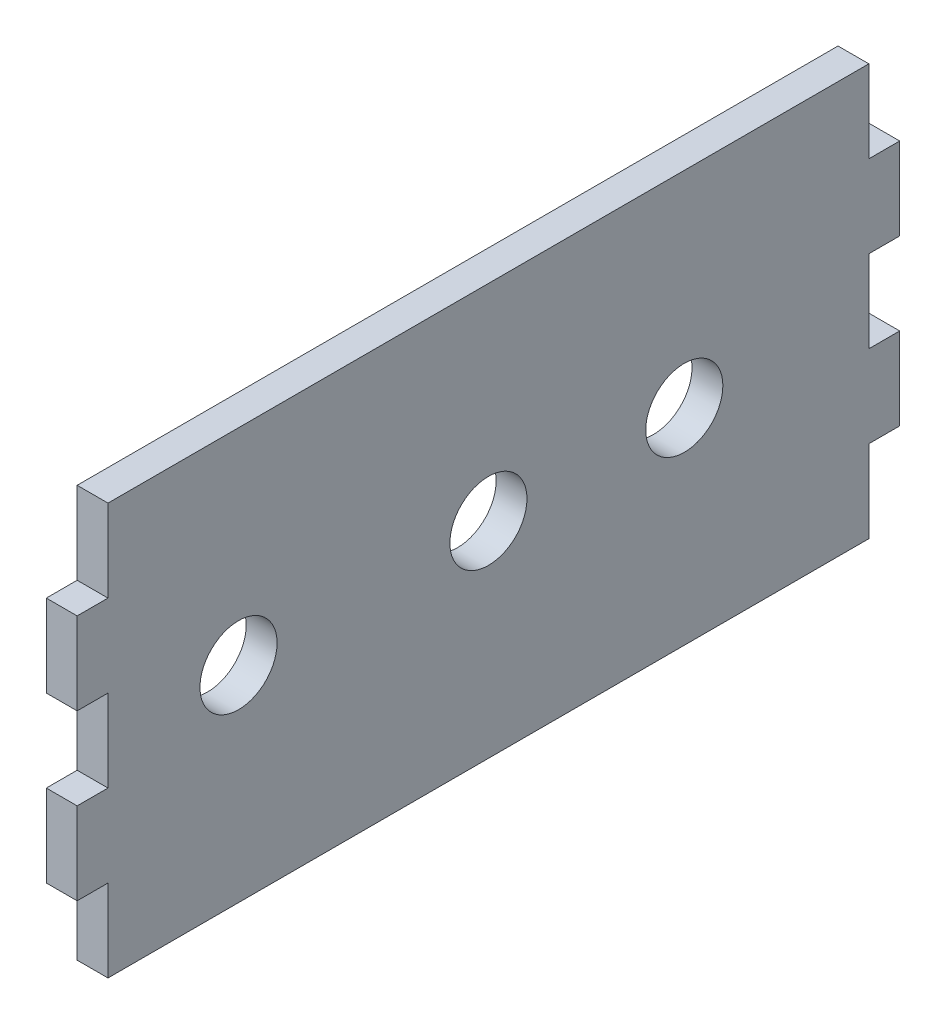
ISO-10303-21;
HEADER;
FILE_DESCRIPTION(('STEP AP214'),'2;1');
FILE_NAME('part.step','',(''),(''),'','','');
FILE_SCHEMA(('AUTOMOTIVE_DESIGN { 1 0 10303 214 1 1 1 1 }'));
ENDSEC;
DATA;
#1=APPLICATION_CONTEXT('core data for automotive mechanical design processes');
#2=APPLICATION_PROTOCOL_DEFINITION('international standard','automotive_design',2000,#1);
#3=PRODUCT_CONTEXT('',#1,'mechanical');
#4=PRODUCT('Part','Part','',(#3));
#5=PRODUCT_RELATED_PRODUCT_CATEGORY('part','',(#4));
#6=PRODUCT_DEFINITION_FORMATION('','',#4);
#7=PRODUCT_DEFINITION_CONTEXT('part definition',#1,'design');
#8=PRODUCT_DEFINITION('design','',#6,#7);
#9=PRODUCT_DEFINITION_SHAPE('','',#8);
#10=(LENGTH_UNIT() NAMED_UNIT(*) SI_UNIT(.MILLI.,.METRE.));
#11=(NAMED_UNIT(*) PLANE_ANGLE_UNIT() SI_UNIT($,.RADIAN.));
#12=(NAMED_UNIT(*) SI_UNIT($,.STERADIAN.) SOLID_ANGLE_UNIT());
#13=UNCERTAINTY_MEASURE_WITH_UNIT(LENGTH_MEASURE(1.E-05),#10,'distance_accuracy_value','');
#14=(GEOMETRIC_REPRESENTATION_CONTEXT(3) GLOBAL_UNCERTAINTY_ASSIGNED_CONTEXT((#13)) GLOBAL_UNIT_ASSIGNED_CONTEXT((#10,
#11,#12)) REPRESENTATION_CONTEXT('',''));
#15=CARTESIAN_POINT('',(0.,0.,0.));
#16=DIRECTION('',(0.,0.,1.));
#17=DIRECTION('',(1.,0.,0.));
#18=AXIS2_PLACEMENT_3D('',#15,#16,#17);
#19=CARTESIAN_POINT('',(6.,-40.0000000000001,80.));
#20=DIRECTION('',(0.,0.,-1.));
#21=DIRECTION('',(-1.,0.,0.));
#22=AXIS2_PLACEMENT_3D('',#19,#20,#21);
#23=PLANE('',#22);
#24=DIRECTION('',(0.,-1.,0.));
#25=VECTOR('',#24,1.);
#26=CARTESIAN_POINT('',(0.,-40.0000000000001,80.));
#27=LINE('',#26,#25);
#28=CARTESIAN_POINT('',(0.,23.9999999999999,80.));
#29=VERTEX_POINT('',#28);
#30=CARTESIAN_POINT('',(0.,7.99999999999999,80.));
#31=VERTEX_POINT('',#30);
#32=EDGE_CURVE('E208',#29,#31,#27,.T.);
#33=ORIENTED_EDGE('',*,*,#32,.T.);
#34=DIRECTION('',(1.,0.,0.));
#35=VECTOR('',#34,1.);
#36=CARTESIAN_POINT('',(0.,7.99999999999999,80.));
#37=LINE('',#36,#35);
#38=CARTESIAN_POINT('',(6.,7.99999999999999,80.));
#39=VERTEX_POINT('',#38);
#40=EDGE_CURVE('E266',#31,#39,#37,.T.);
#41=ORIENTED_EDGE('',*,*,#40,.T.);
#42=DIRECTION('',(0.,-1.,0.));
#43=VECTOR('',#42,1.);
#44=CARTESIAN_POINT('',(6.,-40.0000000000001,80.));
#45=LINE('',#44,#43);
#46=CARTESIAN_POINT('',(6.,23.9999999999999,80.));
#47=VERTEX_POINT('',#46);
#48=EDGE_CURVE('E219',#47,#39,#45,.T.);
#49=ORIENTED_EDGE('',*,*,#48,.F.);
#50=DIRECTION('',(1.,0.,0.));
#51=VECTOR('',#50,1.);
#52=CARTESIAN_POINT('',(0.,23.9999999999999,80.));
#53=LINE('',#52,#51);
#54=EDGE_CURVE('E241',#29,#47,#53,.T.);
#55=ORIENTED_EDGE('',*,*,#54,.F.);
#56=EDGE_LOOP('',(#33,#41,#49,#55));
#57=FACE_BOUND('',#56,.T.);
#58=ADVANCED_FACE('F37',(#57),#23,.F.);
#59=CARTESIAN_POINT('',(6.,-40.,-80.));
#60=DIRECTION('',(0.,0.,1.));
#61=DIRECTION('',(0.,-1.,0.));
#62=AXIS2_PLACEMENT_3D('',#59,#60,#61);
#63=PLANE('',#62);
#64=DIRECTION('',(0.,1.,0.));
#65=VECTOR('',#64,1.);
#66=CARTESIAN_POINT('',(6.,-40.,-80.));
#67=LINE('',#66,#65);
#68=CARTESIAN_POINT('',(6.,-23.9999999999999,-80.));
#69=VERTEX_POINT('',#68);
#70=CARTESIAN_POINT('',(6.,-7.99999999999993,-80.));
#71=VERTEX_POINT('',#70);
#72=EDGE_CURVE('E46',#69,#71,#67,.T.);
#73=ORIENTED_EDGE('',*,*,#72,.F.);
#74=DIRECTION('',(1.,0.,0.));
#75=VECTOR('',#74,1.);
#76=CARTESIAN_POINT('',(0.,-23.9999999999999,-80.));
#77=LINE('',#76,#75);
#78=CARTESIAN_POINT('',(0.,-23.9999999999999,-80.));
#79=VERTEX_POINT('',#78);
#80=EDGE_CURVE('E301',#79,#69,#77,.T.);
#81=ORIENTED_EDGE('',*,*,#80,.F.);
#82=DIRECTION('',(0.,1.,0.));
#83=VECTOR('',#82,1.);
#84=CARTESIAN_POINT('',(0.,-40.,-80.));
#85=LINE('',#84,#83);
#86=CARTESIAN_POINT('',(0.,-7.99999999999993,-80.));
#87=VERTEX_POINT('',#86);
#88=EDGE_CURVE('E204',#79,#87,#85,.T.);
#89=ORIENTED_EDGE('',*,*,#88,.T.);
#90=DIRECTION('',(1.,0.,0.));
#91=VECTOR('',#90,1.);
#92=CARTESIAN_POINT('',(0.,-7.99999999999993,-80.));
#93=LINE('',#92,#91);
#94=EDGE_CURVE('E279',#87,#71,#93,.T.);
#95=ORIENTED_EDGE('',*,*,#94,.T.);
#96=EDGE_LOOP('',(#73,#81,#89,#95));
#97=FACE_BOUND('',#96,.T.);
#98=ADVANCED_FACE('F354',(#97),#63,.F.);
#99=CARTESIAN_POINT('',(0.,-8.00000000000001,80.));
#100=VERTEX_POINT('',#99);
#101=CARTESIAN_POINT('',(0.,-24.,80.));
#102=VERTEX_POINT('',#101);
#103=EDGE_CURVE('E211',#100,#102,#27,.T.);
#104=ORIENTED_EDGE('',*,*,#103,.T.);
#105=DIRECTION('',(1.,0.,0.));
#106=VECTOR('',#105,1.);
#107=CARTESIAN_POINT('',(0.,-24.,80.));
#108=LINE('',#107,#106);
#109=CARTESIAN_POINT('',(6.,-24.,80.));
#110=VERTEX_POINT('',#109);
#111=EDGE_CURVE('E254',#102,#110,#108,.T.);
#112=ORIENTED_EDGE('',*,*,#111,.T.);
#113=CARTESIAN_POINT('',(6.,-8.00000000000001,80.));
#114=VERTEX_POINT('',#113);
#115=EDGE_CURVE('E220',#114,#110,#45,.T.);
#116=ORIENTED_EDGE('',*,*,#115,.F.);
#117=DIRECTION('',(1.,0.,0.));
#118=VECTOR('',#117,1.);
#119=CARTESIAN_POINT('',(0.,-8.00000000000001,80.));
#120=LINE('',#119,#118);
#121=EDGE_CURVE('E259',#100,#114,#120,.T.);
#122=ORIENTED_EDGE('',*,*,#121,.F.);
#123=EDGE_LOOP('',(#104,#112,#116,#122));
#124=FACE_BOUND('',#123,.T.);
#125=ADVANCED_FACE('F39',(#124),#23,.F.);
#126=CARTESIAN_POINT('',(6.,-40.,-80.));
#127=DIRECTION('',(0.,1.,0.));
#128=DIRECTION('',(0.,0.,1.));
#129=AXIS2_PLACEMENT_3D('',#126,#127,#128);
#130=PLANE('',#129);
#131=DIRECTION('',(0.,0.,-1.));
#132=VECTOR('',#131,1.);
#133=CARTESIAN_POINT('',(6.,-40.,-80.));
#134=LINE('',#133,#132);
#135=CARTESIAN_POINT('',(6.,-39.9999999999999,74.));
#136=VERTEX_POINT('',#135);
#137=CARTESIAN_POINT('',(6.,-39.9999999999999,-74.));
#138=VERTEX_POINT('',#137);
#139=EDGE_CURVE('E216',#136,#138,#134,.T.);
#140=ORIENTED_EDGE('',*,*,#139,.F.);
#141=DIRECTION('',(1.,0.,0.));
#142=VECTOR('',#141,1.);
#143=CARTESIAN_POINT('',(0.,-39.9999999999999,74.));
#144=LINE('',#143,#142);
#145=CARTESIAN_POINT('',(0.,-39.9999999999999,74.));
#146=VERTEX_POINT('',#145);
#147=EDGE_CURVE('E317',#146,#136,#144,.T.);
#148=ORIENTED_EDGE('',*,*,#147,.F.);
#149=DIRECTION('',(0.,0.,-1.));
#150=VECTOR('',#149,1.);
#151=CARTESIAN_POINT('',(0.,-40.,-80.));
#152=LINE('',#151,#150);
#153=CARTESIAN_POINT('',(0.,-39.9999999999999,-74.));
#154=VERTEX_POINT('',#153);
#155=EDGE_CURVE('E205',#146,#154,#152,.T.);
#156=ORIENTED_EDGE('',*,*,#155,.T.);
#157=DIRECTION('',(1.,0.,0.));
#158=VECTOR('',#157,1.);
#159=CARTESIAN_POINT('',(0.,-39.9999999999999,-74.));
#160=LINE('',#159,#158);
#161=EDGE_CURVE('E305',#154,#138,#160,.T.);
#162=ORIENTED_EDGE('',*,*,#161,.T.);
#163=EDGE_LOOP('',(#140,#148,#156,#162));
#164=FACE_BOUND('',#163,.T.);
#165=ADVANCED_FACE('F368',(#164),#130,.F.);
#166=CARTESIAN_POINT('',(0.,8.00000000000001,-80.));
#167=VERTEX_POINT('',#166);
#168=CARTESIAN_POINT('',(0.,24.,-80.));
#169=VERTEX_POINT('',#168);
#170=EDGE_CURVE('E194',#167,#169,#85,.T.);
#171=ORIENTED_EDGE('',*,*,#170,.T.);
#172=DIRECTION('',(1.,0.,0.));
#173=VECTOR('',#172,1.);
#174=CARTESIAN_POINT('',(0.,24.,-80.));
#175=LINE('',#174,#173);
#176=CARTESIAN_POINT('',(6.,24.,-80.));
#177=VERTEX_POINT('',#176);
#178=EDGE_CURVE('E291',#169,#177,#175,.T.);
#179=ORIENTED_EDGE('',*,*,#178,.T.);
#180=CARTESIAN_POINT('',(6.,8.00000000000001,-80.));
#181=VERTEX_POINT('',#180);
#182=EDGE_CURVE('E196',#181,#177,#67,.T.);
#183=ORIENTED_EDGE('',*,*,#182,.F.);
#184=DIRECTION('',(1.,0.,0.));
#185=VECTOR('',#184,1.);
#186=CARTESIAN_POINT('',(0.,8.00000000000001,-80.));
#187=LINE('',#186,#185);
#188=EDGE_CURVE('E180',#167,#181,#187,.T.);
#189=ORIENTED_EDGE('',*,*,#188,.F.);
#190=EDGE_LOOP('',(#171,#179,#183,#189));
#191=FACE_BOUND('',#190,.T.);
#192=ADVANCED_FACE('F192',(#191),#63,.F.);
#193=CARTESIAN_POINT('',(6.,39.9999999999999,-80.));
#194=DIRECTION('',(0.,-1.,0.));
#195=DIRECTION('',(0.,0.,-1.));
#196=AXIS2_PLACEMENT_3D('',#193,#194,#195);
#197=PLANE('',#196);
#198=DIRECTION('',(0.,0.,1.));
#199=VECTOR('',#198,1.);
#200=CARTESIAN_POINT('',(6.,39.9999999999999,-80.));
#201=LINE('',#200,#199);
#202=CARTESIAN_POINT('',(6.,40.,-74.));
#203=VERTEX_POINT('',#202);
#204=CARTESIAN_POINT('',(6.,39.9999999999999,74.));
#205=VERTEX_POINT('',#204);
#206=EDGE_CURVE('E11',#203,#205,#201,.T.);
#207=ORIENTED_EDGE('',*,*,#206,.F.);
#208=DIRECTION('',(1.,0.,0.));
#209=VECTOR('',#208,1.);
#210=CARTESIAN_POINT('',(0.,40.,-74.));
#211=LINE('',#210,#209);
#212=CARTESIAN_POINT('',(0.,40.,-74.));
#213=VERTEX_POINT('',#212);
#214=EDGE_CURVE('E287',#213,#203,#211,.T.);
#215=ORIENTED_EDGE('',*,*,#214,.F.);
#216=DIRECTION('',(0.,0.,1.));
#217=VECTOR('',#216,1.);
#218=CARTESIAN_POINT('',(0.,39.9999999999999,-80.));
#219=LINE('',#218,#217);
#220=CARTESIAN_POINT('',(0.,39.9999999999999,74.));
#221=VERTEX_POINT('',#220);
#222=EDGE_CURVE('E41',#213,#221,#219,.T.);
#223=ORIENTED_EDGE('',*,*,#222,.T.);
#224=DIRECTION('',(1.,0.,0.));
#225=VECTOR('',#224,1.);
#226=CARTESIAN_POINT('',(0.,39.9999999999999,74.));
#227=LINE('',#226,#225);
#228=EDGE_CURVE('E227',#221,#205,#227,.T.);
#229=ORIENTED_EDGE('',*,*,#228,.T.);
#230=EDGE_LOOP('',(#207,#215,#223,#229));
#231=FACE_BOUND('',#230,.T.);
#232=ADVANCED_FACE('F405',(#231),#197,.F.);
#233=CARTESIAN_POINT('',(6.,0.,0.));
#234=DIRECTION('',(1.,0.,0.));
#235=DIRECTION('',(0.,0.,-1.));
#236=AXIS2_PLACEMENT_3D('',#233,#234,#235);
#237=PLANE('',#236);
#238=DIRECTION('',(0.,0.,1.));
#239=VECTOR('',#238,1.);
#240=CARTESIAN_POINT('',(6.,-24.,80.));
#241=LINE('',#240,#239);
#242=CARTESIAN_POINT('',(6.,-24.,74.));
#243=VERTEX_POINT('',#242);
#244=EDGE_CURVE('E323',#243,#110,#241,.T.);
#245=ORIENTED_EDGE('',*,*,#244,.F.);
#246=DIRECTION('',(0.,1.,0.));
#247=VECTOR('',#246,1.);
#248=CARTESIAN_POINT('',(6.,-39.9999999999999,74.));
#249=LINE('',#248,#247);
#250=EDGE_CURVE('E308',#136,#243,#249,.T.);
#251=ORIENTED_EDGE('',*,*,#250,.F.);
#252=ORIENTED_EDGE('',*,*,#139,.T.);
#253=DIRECTION('',(0.,-1.,0.));
#254=VECTOR('',#253,1.);
#255=CARTESIAN_POINT('',(6.,-39.9999999999999,-74.));
#256=LINE('',#255,#254);
#257=CARTESIAN_POINT('',(6.,-23.9999999999999,-74.));
#258=VERTEX_POINT('',#257);
#259=EDGE_CURVE('E309',#258,#138,#256,.T.);
#260=ORIENTED_EDGE('',*,*,#259,.F.);
#261=DIRECTION('',(0.,0.,1.));
#262=VECTOR('',#261,1.);
#263=CARTESIAN_POINT('',(6.,-23.9999999999999,-80.));
#264=LINE('',#263,#262);
#265=EDGE_CURVE('E293',#69,#258,#264,.T.);
#266=ORIENTED_EDGE('',*,*,#265,.F.);
#267=ORIENTED_EDGE('',*,*,#72,.T.);
#268=DIRECTION('',(0.,0.,-1.));
#269=VECTOR('',#268,1.);
#270=CARTESIAN_POINT('',(6.,-7.99999999999993,-80.));
#271=LINE('',#270,#269);
#272=CARTESIAN_POINT('',(6.,-7.99999999999994,-73.9999999999999));
#273=VERTEX_POINT('',#272);
#274=EDGE_CURVE('E187',#273,#71,#271,.T.);
#275=ORIENTED_EDGE('',*,*,#274,.F.);
#276=DIRECTION('',(0.,-1.,0.));
#277=VECTOR('',#276,1.);
#278=CARTESIAN_POINT('',(6.,8.00000000000001,-73.9999999999999));
#279=LINE('',#278,#277);
#280=CARTESIAN_POINT('',(6.,8.00000000000001,-73.9999999999999));
#281=VERTEX_POINT('',#280);
#282=EDGE_CURVE('E336',#281,#273,#279,.T.);
#283=ORIENTED_EDGE('',*,*,#282,.F.);
#284=DIRECTION('',(0.,0.,1.));
#285=VECTOR('',#284,1.);
#286=CARTESIAN_POINT('',(6.,8.00000000000001,-80.));
#287=LINE('',#286,#285);
#288=EDGE_CURVE('E339',#181,#281,#287,.T.);
#289=ORIENTED_EDGE('',*,*,#288,.F.);
#290=ORIENTED_EDGE('',*,*,#182,.T.);
#291=DIRECTION('',(0.,0.,-1.));
#292=VECTOR('',#291,1.);
#293=CARTESIAN_POINT('',(6.,24.,-80.));
#294=LINE('',#293,#292);
#295=CARTESIAN_POINT('',(6.,23.9999999999999,-74.));
#296=VERTEX_POINT('',#295);
#297=EDGE_CURVE('E294',#296,#177,#294,.T.);
#298=ORIENTED_EDGE('',*,*,#297,.F.);
#299=DIRECTION('',(0.,-1.,0.));
#300=VECTOR('',#299,1.);
#301=CARTESIAN_POINT('',(6.,40.,-74.));
#302=LINE('',#301,#300);
#303=EDGE_CURVE('E269',#203,#296,#302,.T.);
#304=ORIENTED_EDGE('',*,*,#303,.F.);
#305=ORIENTED_EDGE('',*,*,#206,.T.);
#306=DIRECTION('',(0.,1.,0.));
#307=VECTOR('',#306,1.);
#308=CARTESIAN_POINT('',(6.,39.9999999999999,74.));
#309=LINE('',#308,#307);
#310=CARTESIAN_POINT('',(6.,23.9999999999999,74.));
#311=VERTEX_POINT('',#310);
#312=EDGE_CURVE('E248',#311,#205,#309,.T.);
#313=ORIENTED_EDGE('',*,*,#312,.F.);
#314=DIRECTION('',(0.,0.,-1.));
#315=VECTOR('',#314,1.);
#316=CARTESIAN_POINT('',(6.,23.9999999999999,80.));
#317=LINE('',#316,#315);
#318=EDGE_CURVE('E251',#47,#311,#317,.T.);
#319=ORIENTED_EDGE('',*,*,#318,.F.);
#320=ORIENTED_EDGE('',*,*,#48,.T.);
#321=DIRECTION('',(0.,0.,1.));
#322=VECTOR('',#321,1.);
#323=CARTESIAN_POINT('',(6.,7.99999999999999,80.));
#324=LINE('',#323,#322);
#325=CARTESIAN_POINT('',(6.,7.99999999999999,73.9999999999999));
#326=VERTEX_POINT('',#325);
#327=EDGE_CURVE('E270',#326,#39,#324,.T.);
#328=ORIENTED_EDGE('',*,*,#327,.F.);
#329=DIRECTION('',(0.,1.,0.));
#330=VECTOR('',#329,1.);
#331=CARTESIAN_POINT('',(6.,7.99999999999999,73.9999999999999));
#332=LINE('',#331,#330);
#333=CARTESIAN_POINT('',(6.,-8.00000000000001,73.9999999999999));
#334=VERTEX_POINT('',#333);
#335=EDGE_CURVE('E273',#334,#326,#332,.T.);
#336=ORIENTED_EDGE('',*,*,#335,.F.);
#337=DIRECTION('',(0.,0.,-1.));
#338=VECTOR('',#337,1.);
#339=CARTESIAN_POINT('',(6.,-8.00000000000001,80.));
#340=LINE('',#339,#338);
#341=EDGE_CURVE('E276',#114,#334,#340,.T.);
#342=ORIENTED_EDGE('',*,*,#341,.F.);
#343=ORIENTED_EDGE('',*,*,#115,.T.);
#344=EDGE_LOOP('',(#245,#251,#252,#260,#266,#267,#275,#283,#289,#290,#298,#304,#305,#313,#319,
#320,#328,#336,#342,#343));
#345=FACE_BOUND('',#344,.T.);
#346=CARTESIAN_POINT('',(6.,0.,48.61));
#347=DIRECTION('',(1.,0.,0.));
#348=DIRECTION('',(0.,0.,-1.));
#349=AXIS2_PLACEMENT_3D('',#346,#347,#348);
#350=CIRCLE('',#349,7.5);
#351=CARTESIAN_POINT('',(6.,0.,41.11));
#352=VERTEX_POINT('',#351);
#353=EDGE_CURVE('E236',#352,#352,#350,.T.);
#354=ORIENTED_EDGE('',*,*,#353,.F.);
#355=EDGE_LOOP('',(#354));
#356=FACE_BOUND('',#355,.T.);
#357=CARTESIAN_POINT('',(6.,0.,0.));
#358=DIRECTION('',(1.,0.,0.));
#359=DIRECTION('',(0.,0.,-1.));
#360=AXIS2_PLACEMENT_3D('',#357,#358,#359);
#361=CIRCLE('',#360,7.5);
#362=CARTESIAN_POINT('',(6.,0.,-7.5));
#363=VERTEX_POINT('',#362);
#364=EDGE_CURVE('E230',#363,#363,#361,.T.);
#365=ORIENTED_EDGE('',*,*,#364,.F.);
#366=EDGE_LOOP('',(#365));
#367=FACE_BOUND('',#366,.T.);
#368=CARTESIAN_POINT('',(6.,0.,-38.1));
#369=DIRECTION('',(1.,0.,0.));
#370=DIRECTION('',(0.,0.,-1.));
#371=AXIS2_PLACEMENT_3D('',#368,#369,#370);
#372=CIRCLE('',#371,7.5);
#373=CARTESIAN_POINT('',(6.,0.,-45.6));
#374=VERTEX_POINT('',#373);
#375=EDGE_CURVE('E223',#374,#374,#372,.T.);
#376=ORIENTED_EDGE('',*,*,#375,.F.);
#377=EDGE_LOOP('',(#376));
#378=FACE_BOUND('',#377,.T.);
#379=ADVANCED_FACE('F359',(#345,#356,#367,#378),#237,.T.);
#380=CARTESIAN_POINT('',(0.,0.,0.));
#381=DIRECTION('',(1.,0.,0.));
#382=DIRECTION('',(0.,0.,-1.));
#383=AXIS2_PLACEMENT_3D('',#380,#381,#382);
#384=PLANE('',#383);
#385=CARTESIAN_POINT('',(0.,0.,48.61));
#386=DIRECTION('',(1.,0.,0.));
#387=DIRECTION('',(0.,0.,-1.));
#388=AXIS2_PLACEMENT_3D('',#385,#386,#387);
#389=CIRCLE('',#388,7.5);
#390=CARTESIAN_POINT('',(0.,0.,41.11));
#391=VERTEX_POINT('',#390);
#392=EDGE_CURVE('E213',#391,#391,#389,.T.);
#393=ORIENTED_EDGE('',*,*,#392,.T.);
#394=EDGE_LOOP('',(#393));
#395=FACE_BOUND('',#394,.T.);
#396=CARTESIAN_POINT('',(0.,0.,0.));
#397=DIRECTION('',(1.,0.,0.));
#398=DIRECTION('',(0.,0.,-1.));
#399=AXIS2_PLACEMENT_3D('',#396,#397,#398);
#400=CIRCLE('',#399,7.5);
#401=CARTESIAN_POINT('',(0.,0.,-7.5));
#402=VERTEX_POINT('',#401);
#403=EDGE_CURVE('E233',#402,#402,#400,.T.);
#404=ORIENTED_EDGE('',*,*,#403,.T.);
#405=EDGE_LOOP('',(#404));
#406=FACE_BOUND('',#405,.T.);
#407=CARTESIAN_POINT('',(0.,0.,-38.1));
#408=DIRECTION('',(1.,0.,0.));
#409=DIRECTION('',(0.,0.,-1.));
#410=AXIS2_PLACEMENT_3D('',#407,#408,#409);
#411=CIRCLE('',#410,7.5);
#412=CARTESIAN_POINT('',(0.,0.,-45.6));
#413=VERTEX_POINT('',#412);
#414=EDGE_CURVE('E226',#413,#413,#411,.T.);
#415=ORIENTED_EDGE('',*,*,#414,.T.);
#416=EDGE_LOOP('',(#415));
#417=FACE_BOUND('',#416,.T.);
#418=DIRECTION('',(0.,1.,0.));
#419=VECTOR('',#418,1.);
#420=CARTESIAN_POINT('',(0.,-39.9999999999999,74.));
#421=LINE('',#420,#419);
#422=CARTESIAN_POINT('',(0.,-24.,74.));
#423=VERTEX_POINT('',#422);
#424=EDGE_CURVE('E325',#146,#423,#421,.T.);
#425=ORIENTED_EDGE('',*,*,#424,.T.);
#426=DIRECTION('',(0.,0.,1.));
#427=VECTOR('',#426,1.);
#428=CARTESIAN_POINT('',(0.,-24.,80.));
#429=LINE('',#428,#427);
#430=EDGE_CURVE('E54',#423,#102,#429,.T.);
#431=ORIENTED_EDGE('',*,*,#430,.T.);
#432=ORIENTED_EDGE('',*,*,#103,.F.);
#433=DIRECTION('',(0.,0.,-1.));
#434=VECTOR('',#433,1.);
#435=CARTESIAN_POINT('',(0.,-8.00000000000001,80.));
#436=LINE('',#435,#434);
#437=CARTESIAN_POINT('',(0.,-8.00000000000001,73.9999999999999));
#438=VERTEX_POINT('',#437);
#439=EDGE_CURVE('E272',#100,#438,#436,.T.);
#440=ORIENTED_EDGE('',*,*,#439,.T.);
#441=DIRECTION('',(0.,1.,0.));
#442=VECTOR('',#441,1.);
#443=CARTESIAN_POINT('',(0.,7.99999999999999,73.9999999999999));
#444=LINE('',#443,#442);
#445=CARTESIAN_POINT('',(0.,7.99999999999999,73.9999999999999));
#446=VERTEX_POINT('',#445);
#447=EDGE_CURVE('E282',#438,#446,#444,.T.);
#448=ORIENTED_EDGE('',*,*,#447,.T.);
#449=DIRECTION('',(0.,0.,1.));
#450=VECTOR('',#449,1.);
#451=CARTESIAN_POINT('',(0.,7.99999999999999,80.));
#452=LINE('',#451,#450);
#453=EDGE_CURVE('E262',#446,#31,#452,.T.);
#454=ORIENTED_EDGE('',*,*,#453,.T.);
#455=ORIENTED_EDGE('',*,*,#32,.F.);
#456=DIRECTION('',(0.,0.,-1.));
#457=VECTOR('',#456,1.);
#458=CARTESIAN_POINT('',(0.,23.9999999999999,80.));
#459=LINE('',#458,#457);
#460=CARTESIAN_POINT('',(0.,23.9999999999999,74.));
#461=VERTEX_POINT('',#460);
#462=EDGE_CURVE('E250',#29,#461,#459,.T.);
#463=ORIENTED_EDGE('',*,*,#462,.T.);
#464=DIRECTION('',(0.,1.,0.));
#465=VECTOR('',#464,1.);
#466=CARTESIAN_POINT('',(0.,39.9999999999999,74.));
#467=LINE('',#466,#465);
#468=EDGE_CURVE('E244',#461,#221,#467,.T.);
#469=ORIENTED_EDGE('',*,*,#468,.T.);
#470=ORIENTED_EDGE('',*,*,#222,.F.);
#471=DIRECTION('',(0.,-1.,0.));
#472=VECTOR('',#471,1.);
#473=CARTESIAN_POINT('',(0.,40.,-74.));
#474=LINE('',#473,#472);
#475=CARTESIAN_POINT('',(0.,23.9999999999999,-74.));
#476=VERTEX_POINT('',#475);
#477=EDGE_CURVE('E296',#213,#476,#474,.T.);
#478=ORIENTED_EDGE('',*,*,#477,.T.);
#479=DIRECTION('',(0.,0.,-1.));
#480=VECTOR('',#479,1.);
#481=CARTESIAN_POINT('',(0.,24.,-80.));
#482=LINE('',#481,#480);
#483=EDGE_CURVE('E203',#476,#169,#482,.T.);
#484=ORIENTED_EDGE('',*,*,#483,.T.);
#485=ORIENTED_EDGE('',*,*,#170,.F.);
#486=DIRECTION('',(0.,0.,1.));
#487=VECTOR('',#486,1.);
#488=CARTESIAN_POINT('',(0.,8.00000000000001,-80.));
#489=LINE('',#488,#487);
#490=CARTESIAN_POINT('',(0.,8.00000000000001,-73.9999999999999));
#491=VERTEX_POINT('',#490);
#492=EDGE_CURVE('E176',#167,#491,#489,.T.);
#493=ORIENTED_EDGE('',*,*,#492,.T.);
#494=DIRECTION('',(0.,-1.,0.));
#495=VECTOR('',#494,1.);
#496=CARTESIAN_POINT('',(0.,8.00000000000001,-73.9999999999999));
#497=LINE('',#496,#495);
#498=CARTESIAN_POINT('',(0.,-7.99999999999994,-73.9999999999999));
#499=VERTEX_POINT('',#498);
#500=EDGE_CURVE('E186',#491,#499,#497,.T.);
#501=ORIENTED_EDGE('',*,*,#500,.T.);
#502=DIRECTION('',(0.,0.,-1.));
#503=VECTOR('',#502,1.);
#504=CARTESIAN_POINT('',(0.,-7.99999999999993,-80.));
#505=LINE('',#504,#503);
#506=EDGE_CURVE('E197',#499,#87,#505,.T.);
#507=ORIENTED_EDGE('',*,*,#506,.T.);
#508=ORIENTED_EDGE('',*,*,#88,.F.);
#509=DIRECTION('',(0.,0.,1.));
#510=VECTOR('',#509,1.);
#511=CARTESIAN_POINT('',(0.,-23.9999999999999,-80.));
#512=LINE('',#511,#510);
#513=CARTESIAN_POINT('',(0.,-23.9999999999999,-74.));
#514=VERTEX_POINT('',#513);
#515=EDGE_CURVE('E311',#79,#514,#512,.T.);
#516=ORIENTED_EDGE('',*,*,#515,.T.);
#517=DIRECTION('',(0.,-1.,0.));
#518=VECTOR('',#517,1.);
#519=CARTESIAN_POINT('',(0.,-39.9999999999999,-74.));
#520=LINE('',#519,#518);
#521=EDGE_CURVE('E62',#514,#154,#520,.T.);
#522=ORIENTED_EDGE('',*,*,#521,.T.);
#523=ORIENTED_EDGE('',*,*,#155,.F.);
#524=EDGE_LOOP('',(#425,#431,#432,#440,#448,#454,#455,#463,#469,#470,#478,#484,#485,#493,#501,
#507,#508,#516,#522,#523));
#525=FACE_BOUND('',#524,.T.);
#526=ADVANCED_FACE('F201',(#395,#406,#417,#525),#384,.F.);
#527=CARTESIAN_POINT('',(0.,0.,-38.1));
#528=DIRECTION('',(1.,0.,0.));
#529=DIRECTION('',(0.,0.,-1.));
#530=AXIS2_PLACEMENT_3D('',#527,#528,#529);
#531=CYLINDRICAL_SURFACE('',#530,7.5);
#532=ORIENTED_EDGE('',*,*,#414,.F.);
#533=EDGE_LOOP('',(#532));
#534=FACE_BOUND('',#533,.T.);
#535=ORIENTED_EDGE('',*,*,#375,.T.);
#536=EDGE_LOOP('',(#535));
#537=FACE_BOUND('',#536,.T.);
#538=ADVANCED_FACE('F441',(#534,#537),#531,.F.);
#539=CARTESIAN_POINT('',(0.,0.,0.));
#540=DIRECTION('',(1.,0.,0.));
#541=DIRECTION('',(0.,0.,-1.));
#542=AXIS2_PLACEMENT_3D('',#539,#540,#541);
#543=CYLINDRICAL_SURFACE('',#542,7.5);
#544=ORIENTED_EDGE('',*,*,#403,.F.);
#545=EDGE_LOOP('',(#544));
#546=FACE_BOUND('',#545,.T.);
#547=ORIENTED_EDGE('',*,*,#364,.T.);
#548=EDGE_LOOP('',(#547));
#549=FACE_BOUND('',#548,.T.);
#550=ADVANCED_FACE('F447',(#546,#549),#543,.F.);
#551=CARTESIAN_POINT('',(0.,0.,48.61));
#552=DIRECTION('',(1.,0.,0.));
#553=DIRECTION('',(0.,0.,-1.));
#554=AXIS2_PLACEMENT_3D('',#551,#552,#553);
#555=CYLINDRICAL_SURFACE('',#554,7.5);
#556=ORIENTED_EDGE('',*,*,#392,.F.);
#557=EDGE_LOOP('',(#556));
#558=FACE_BOUND('',#557,.T.);
#559=ORIENTED_EDGE('',*,*,#353,.T.);
#560=EDGE_LOOP('',(#559));
#561=FACE_BOUND('',#560,.T.);
#562=ADVANCED_FACE('F451',(#558,#561),#555,.F.);
#563=CARTESIAN_POINT('',(0.,39.9999999999999,74.));
#564=DIRECTION('',(0.,0.,-1.));
#565=DIRECTION('',(-1.,0.,0.));
#566=AXIS2_PLACEMENT_3D('',#563,#564,#565);
#567=PLANE('',#566);
#568=ORIENTED_EDGE('',*,*,#312,.T.);
#569=ORIENTED_EDGE('',*,*,#228,.F.);
#570=ORIENTED_EDGE('',*,*,#468,.F.);
#571=DIRECTION('',(1.,0.,0.));
#572=VECTOR('',#571,1.);
#573=CARTESIAN_POINT('',(0.,23.9999999999999,74.));
#574=LINE('',#573,#572);
#575=EDGE_CURVE('E243',#461,#311,#574,.T.);
#576=ORIENTED_EDGE('',*,*,#575,.T.);
#577=EDGE_LOOP('',(#568,#569,#570,#576));
#578=FACE_BOUND('',#577,.T.);
#579=ADVANCED_FACE('F402',(#578),#567,.F.);
#580=CARTESIAN_POINT('',(0.,23.9999999999999,80.));
#581=DIRECTION('',(0.,-1.,0.));
#582=DIRECTION('',(0.,0.,-1.));
#583=AXIS2_PLACEMENT_3D('',#580,#581,#582);
#584=PLANE('',#583);
#585=ORIENTED_EDGE('',*,*,#318,.T.);
#586=ORIENTED_EDGE('',*,*,#575,.F.);
#587=ORIENTED_EDGE('',*,*,#462,.F.);
#588=ORIENTED_EDGE('',*,*,#54,.T.);
#589=EDGE_LOOP('',(#585,#586,#587,#588));
#590=FACE_BOUND('',#589,.T.);
#591=ADVANCED_FACE('F396',(#590),#584,.F.);
#592=CARTESIAN_POINT('',(0.,-7.99999999999993,-80.));
#593=DIRECTION('',(0.,-1.,0.));
#594=DIRECTION('',(0.,0.,-1.));
#595=AXIS2_PLACEMENT_3D('',#592,#593,#594);
#596=PLANE('',#595);
#597=ORIENTED_EDGE('',*,*,#274,.T.);
#598=ORIENTED_EDGE('',*,*,#94,.F.);
#599=ORIENTED_EDGE('',*,*,#506,.F.);
#600=DIRECTION('',(1.,0.,0.));
#601=VECTOR('',#600,1.);
#602=CARTESIAN_POINT('',(0.,-7.99999999999994,-73.9999999999999));
#603=LINE('',#602,#601);
#604=EDGE_CURVE('E331',#499,#273,#603,.T.);
#605=ORIENTED_EDGE('',*,*,#604,.T.);
#606=EDGE_LOOP('',(#597,#598,#599,#605));
#607=FACE_BOUND('',#606,.T.);
#608=ADVANCED_FACE('F350',(#607),#596,.F.);
#609=CARTESIAN_POINT('',(0.,8.00000000000001,-73.9999999999999));
#610=DIRECTION('',(0.,0.,1.));
#611=DIRECTION('',(1.,0.,0.));
#612=AXIS2_PLACEMENT_3D('',#609,#610,#611);
#613=PLANE('',#612);
#614=ORIENTED_EDGE('',*,*,#282,.T.);
#615=ORIENTED_EDGE('',*,*,#604,.F.);
#616=ORIENTED_EDGE('',*,*,#500,.F.);
#617=DIRECTION('',(1.,0.,0.));
#618=VECTOR('',#617,1.);
#619=CARTESIAN_POINT('',(0.,8.00000000000001,-73.9999999999999));
#620=LINE('',#619,#618);
#621=EDGE_CURVE('E182',#491,#281,#620,.T.);
#622=ORIENTED_EDGE('',*,*,#621,.T.);
#623=EDGE_LOOP('',(#614,#615,#616,#622));
#624=FACE_BOUND('',#623,.T.);
#625=ADVANCED_FACE('F346',(#624),#613,.F.);
#626=CARTESIAN_POINT('',(0.,8.00000000000001,-80.));
#627=DIRECTION('',(0.,1.,0.));
#628=DIRECTION('',(0.,0.,1.));
#629=AXIS2_PLACEMENT_3D('',#626,#627,#628);
#630=PLANE('',#629);
#631=ORIENTED_EDGE('',*,*,#288,.T.);
#632=ORIENTED_EDGE('',*,*,#621,.F.);
#633=ORIENTED_EDGE('',*,*,#492,.F.);
#634=ORIENTED_EDGE('',*,*,#188,.T.);
#635=EDGE_LOOP('',(#631,#632,#633,#634));
#636=FACE_BOUND('',#635,.T.);
#637=ADVANCED_FACE('F179',(#636),#630,.F.);
#638=CARTESIAN_POINT('',(0.,7.99999999999999,80.));
#639=DIRECTION('',(0.,1.,0.));
#640=DIRECTION('',(0.,0.,1.));
#641=AXIS2_PLACEMENT_3D('',#638,#639,#640);
#642=PLANE('',#641);
#643=ORIENTED_EDGE('',*,*,#327,.T.);
#644=ORIENTED_EDGE('',*,*,#40,.F.);
#645=ORIENTED_EDGE('',*,*,#453,.F.);
#646=DIRECTION('',(1.,0.,0.));
#647=VECTOR('',#646,1.);
#648=CARTESIAN_POINT('',(0.,7.99999999999999,73.9999999999999));
#649=LINE('',#648,#647);
#650=EDGE_CURVE('E264',#446,#326,#649,.T.);
#651=ORIENTED_EDGE('',*,*,#650,.T.);
#652=EDGE_LOOP('',(#643,#644,#645,#651));
#653=FACE_BOUND('',#652,.T.);
#654=ADVANCED_FACE('F387',(#653),#642,.F.);
#655=CARTESIAN_POINT('',(0.,7.99999999999999,73.9999999999999));
#656=DIRECTION('',(0.,0.,-1.));
#657=DIRECTION('',(-1.,0.,0.));
#658=AXIS2_PLACEMENT_3D('',#655,#656,#657);
#659=PLANE('',#658);
#660=ORIENTED_EDGE('',*,*,#335,.T.);
#661=ORIENTED_EDGE('',*,*,#650,.F.);
#662=ORIENTED_EDGE('',*,*,#447,.F.);
#663=DIRECTION('',(1.,0.,0.));
#664=VECTOR('',#663,1.);
#665=CARTESIAN_POINT('',(0.,-8.00000000000001,73.9999999999999));
#666=LINE('',#665,#664);
#667=EDGE_CURVE('E261',#438,#334,#666,.T.);
#668=ORIENTED_EDGE('',*,*,#667,.T.);
#669=EDGE_LOOP('',(#660,#661,#662,#668));
#670=FACE_BOUND('',#669,.T.);
#671=ADVANCED_FACE('F383',(#670),#659,.F.);
#672=CARTESIAN_POINT('',(0.,-8.00000000000001,80.));
#673=DIRECTION('',(0.,-1.,0.));
#674=DIRECTION('',(0.,0.,-1.));
#675=AXIS2_PLACEMENT_3D('',#672,#673,#674);
#676=PLANE('',#675);
#677=ORIENTED_EDGE('',*,*,#341,.T.);
#678=ORIENTED_EDGE('',*,*,#667,.F.);
#679=ORIENTED_EDGE('',*,*,#439,.F.);
#680=ORIENTED_EDGE('',*,*,#121,.T.);
#681=EDGE_LOOP('',(#677,#678,#679,#680));
#682=FACE_BOUND('',#681,.T.);
#683=ADVANCED_FACE('F380',(#682),#676,.F.);
#684=CARTESIAN_POINT('',(0.,24.,-80.));
#685=DIRECTION('',(0.,-1.,0.));
#686=DIRECTION('',(0.,0.,-1.));
#687=AXIS2_PLACEMENT_3D('',#684,#685,#686);
#688=PLANE('',#687);
#689=ORIENTED_EDGE('',*,*,#297,.T.);
#690=ORIENTED_EDGE('',*,*,#178,.F.);
#691=ORIENTED_EDGE('',*,*,#483,.F.);
#692=DIRECTION('',(1.,0.,0.));
#693=VECTOR('',#692,1.);
#694=CARTESIAN_POINT('',(0.,23.9999999999999,-74.));
#695=LINE('',#694,#693);
#696=EDGE_CURVE('E289',#476,#296,#695,.T.);
#697=ORIENTED_EDGE('',*,*,#696,.T.);
#698=EDGE_LOOP('',(#689,#690,#691,#697));
#699=FACE_BOUND('',#698,.T.);
#700=ADVANCED_FACE('F413',(#699),#688,.F.);
#701=CARTESIAN_POINT('',(0.,40.,-74.));
#702=DIRECTION('',(0.,0.,1.));
#703=DIRECTION('',(1.,0.,0.));
#704=AXIS2_PLACEMENT_3D('',#701,#702,#703);
#705=PLANE('',#704);
#706=ORIENTED_EDGE('',*,*,#303,.T.);
#707=ORIENTED_EDGE('',*,*,#696,.F.);
#708=ORIENTED_EDGE('',*,*,#477,.F.);
#709=ORIENTED_EDGE('',*,*,#214,.T.);
#710=EDGE_LOOP('',(#706,#707,#708,#709));
#711=FACE_BOUND('',#710,.T.);
#712=ADVANCED_FACE('F410',(#711),#705,.F.);
#713=CARTESIAN_POINT('',(0.,-39.9999999999999,-74.));
#714=DIRECTION('',(0.,0.,1.));
#715=DIRECTION('',(0.,-1.,0.));
#716=AXIS2_PLACEMENT_3D('',#713,#714,#715);
#717=PLANE('',#716);
#718=ORIENTED_EDGE('',*,*,#259,.T.);
#719=ORIENTED_EDGE('',*,*,#161,.F.);
#720=ORIENTED_EDGE('',*,*,#521,.F.);
#721=DIRECTION('',(1.,0.,0.));
#722=VECTOR('',#721,1.);
#723=CARTESIAN_POINT('',(0.,-23.9999999999999,-74.));
#724=LINE('',#723,#722);
#725=EDGE_CURVE('E303',#514,#258,#724,.T.);
#726=ORIENTED_EDGE('',*,*,#725,.T.);
#727=EDGE_LOOP('',(#718,#719,#720,#726));
#728=FACE_BOUND('',#727,.T.);
#729=ADVANCED_FACE('F420',(#728),#717,.F.);
#730=CARTESIAN_POINT('',(0.,-23.9999999999999,-80.));
#731=DIRECTION('',(0.,1.,0.));
#732=DIRECTION('',(0.,0.,1.));
#733=AXIS2_PLACEMENT_3D('',#730,#731,#732);
#734=PLANE('',#733);
#735=ORIENTED_EDGE('',*,*,#265,.T.);
#736=ORIENTED_EDGE('',*,*,#725,.F.);
#737=ORIENTED_EDGE('',*,*,#515,.F.);
#738=ORIENTED_EDGE('',*,*,#80,.T.);
#739=EDGE_LOOP('',(#735,#736,#737,#738));
#740=FACE_BOUND('',#739,.T.);
#741=ADVANCED_FACE('F363',(#740),#734,.F.);
#742=CARTESIAN_POINT('',(0.,-24.,80.));
#743=DIRECTION('',(0.,1.,0.));
#744=DIRECTION('',(0.,0.,1.));
#745=AXIS2_PLACEMENT_3D('',#742,#743,#744);
#746=PLANE('',#745);
#747=ORIENTED_EDGE('',*,*,#244,.T.);
#748=ORIENTED_EDGE('',*,*,#111,.F.);
#749=ORIENTED_EDGE('',*,*,#430,.F.);
#750=DIRECTION('',(1.,0.,0.));
#751=VECTOR('',#750,1.);
#752=CARTESIAN_POINT('',(0.,-24.,74.));
#753=LINE('',#752,#751);
#754=EDGE_CURVE('E319',#423,#243,#753,.T.);
#755=ORIENTED_EDGE('',*,*,#754,.T.);
#756=EDGE_LOOP('',(#747,#748,#749,#755));
#757=FACE_BOUND('',#756,.T.);
#758=ADVANCED_FACE('F374',(#757),#746,.F.);
#759=CARTESIAN_POINT('',(0.,-39.9999999999999,74.));
#760=DIRECTION('',(0.,0.,-1.));
#761=DIRECTION('',(0.,1.,0.));
#762=AXIS2_PLACEMENT_3D('',#759,#760,#761);
#763=PLANE('',#762);
#764=ORIENTED_EDGE('',*,*,#250,.T.);
#765=ORIENTED_EDGE('',*,*,#754,.F.);
#766=ORIENTED_EDGE('',*,*,#424,.F.);
#767=ORIENTED_EDGE('',*,*,#147,.T.);
#768=EDGE_LOOP('',(#764,#765,#766,#767));
#769=FACE_BOUND('',#768,.T.);
#770=ADVANCED_FACE('F371',(#769),#763,.F.);
#771=CLOSED_SHELL('',(#58,#98,#125,#165,#192,#232,#379,#526,#538,#550,#562,#579,#591,#608,#625,
#637,#654,#671,#683,#700,#712,#729,#741,#758,#770));
#772=MANIFOLD_SOLID_BREP('B2',#771);
#773=ADVANCED_BREP_SHAPE_REPRESENTATION('',(#18,#772),#14);
#774=SHAPE_DEFINITION_REPRESENTATION(#9,#773);
ENDSEC;
END-ISO-10303-21;
